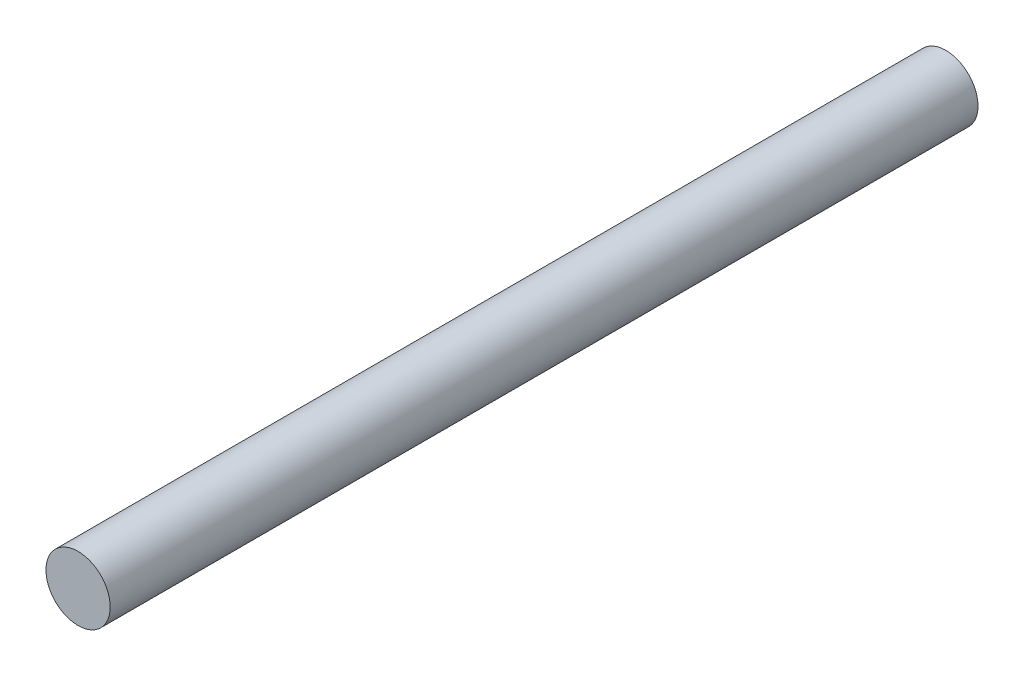
ISO-10303-21;
HEADER;
FILE_DESCRIPTION(('STEP AP214'),'2;1');
FILE_NAME('part.step','',(''),(''),'','','');
FILE_SCHEMA(('AUTOMOTIVE_DESIGN { 1 0 10303 214 1 1 1 1 }'));
ENDSEC;
DATA;
#1=APPLICATION_CONTEXT('core data for automotive mechanical design processes');
#2=APPLICATION_PROTOCOL_DEFINITION('international standard','automotive_design',2000,#1);
#3=PRODUCT_CONTEXT('',#1,'mechanical');
#4=PRODUCT('Part','Part','',(#3));
#5=PRODUCT_RELATED_PRODUCT_CATEGORY('part','',(#4));
#6=PRODUCT_DEFINITION_FORMATION('','',#4);
#7=PRODUCT_DEFINITION_CONTEXT('part definition',#1,'design');
#8=PRODUCT_DEFINITION('design','',#6,#7);
#9=PRODUCT_DEFINITION_SHAPE('','',#8);
#10=(LENGTH_UNIT() NAMED_UNIT(*) SI_UNIT(.MILLI.,.METRE.));
#11=(NAMED_UNIT(*) PLANE_ANGLE_UNIT() SI_UNIT($,.RADIAN.));
#12=(NAMED_UNIT(*) SI_UNIT($,.STERADIAN.) SOLID_ANGLE_UNIT());
#13=UNCERTAINTY_MEASURE_WITH_UNIT(LENGTH_MEASURE(1.E-05),#10,'distance_accuracy_value','');
#14=(GEOMETRIC_REPRESENTATION_CONTEXT(3) GLOBAL_UNCERTAINTY_ASSIGNED_CONTEXT((#13)) GLOBAL_UNIT_ASSIGNED_CONTEXT((#10,
#11,#12)) REPRESENTATION_CONTEXT('',''));
#15=CARTESIAN_POINT('',(0.,0.,0.));
#16=DIRECTION('',(0.,0.,1.));
#17=DIRECTION('',(1.,0.,0.));
#18=AXIS2_PLACEMENT_3D('',#15,#16,#17);
#19=CARTESIAN_POINT('',(0.,0.,81.));
#20=DIRECTION('',(0.,0.,-1.));
#21=DIRECTION('',(-1.,0.,0.));
#22=AXIS2_PLACEMENT_3D('',#19,#20,#21);
#23=CYLINDRICAL_SURFACE('',#22,3.);
#24=CARTESIAN_POINT('',(0.,0.,81.));
#25=DIRECTION('',(0.,0.,1.));
#26=DIRECTION('',(1.,0.,0.));
#27=AXIS2_PLACEMENT_3D('',#24,#25,#26);
#28=CIRCLE('',#27,3.);
#29=CARTESIAN_POINT('',(3.,0.,81.));
#30=VERTEX_POINT('',#29);
#31=EDGE_CURVE('E10',#30,#30,#28,.T.);
#32=ORIENTED_EDGE('',*,*,#31,.F.);
#33=EDGE_LOOP('',(#32));
#34=FACE_BOUND('',#33,.T.);
#35=CARTESIAN_POINT('',(0.,0.,0.));
#36=DIRECTION('',(0.,0.,1.));
#37=DIRECTION('',(1.,0.,0.));
#38=AXIS2_PLACEMENT_3D('',#35,#36,#37);
#39=CIRCLE('',#38,3.);
#40=CARTESIAN_POINT('',(3.,0.,0.));
#41=VERTEX_POINT('',#40);
#42=EDGE_CURVE('E37',#41,#41,#39,.T.);
#43=ORIENTED_EDGE('',*,*,#42,.T.);
#44=EDGE_LOOP('',(#43));
#45=FACE_BOUND('',#44,.T.);
#46=ADVANCED_FACE('F34',(#34,#45),#23,.T.);
#47=CARTESIAN_POINT('',(0.,0.,81.));
#48=DIRECTION('',(0.,0.,1.));
#49=DIRECTION('',(1.,0.,0.));
#50=AXIS2_PLACEMENT_3D('',#47,#48,#49);
#51=PLANE('',#50);
#52=ORIENTED_EDGE('',*,*,#31,.T.);
#53=EDGE_LOOP('',(#52));
#54=FACE_BOUND('',#53,.T.);
#55=ADVANCED_FACE('F49',(#54),#51,.T.);
#56=CARTESIAN_POINT('',(0.,0.,0.));
#57=DIRECTION('',(0.,0.,1.));
#58=DIRECTION('',(1.,0.,0.));
#59=AXIS2_PLACEMENT_3D('',#56,#57,#58);
#60=PLANE('',#59);
#61=ORIENTED_EDGE('',*,*,#42,.F.);
#62=EDGE_LOOP('',(#61));
#63=FACE_BOUND('',#62,.T.);
#64=ADVANCED_FACE('F47',(#63),#60,.F.);
#65=CLOSED_SHELL('',(#46,#55,#64));
#66=MANIFOLD_SOLID_BREP('B2',#65);
#67=ADVANCED_BREP_SHAPE_REPRESENTATION('',(#18,#66),#14);
#68=SHAPE_DEFINITION_REPRESENTATION(#9,#67);
ENDSEC;
END-ISO-10303-21;
